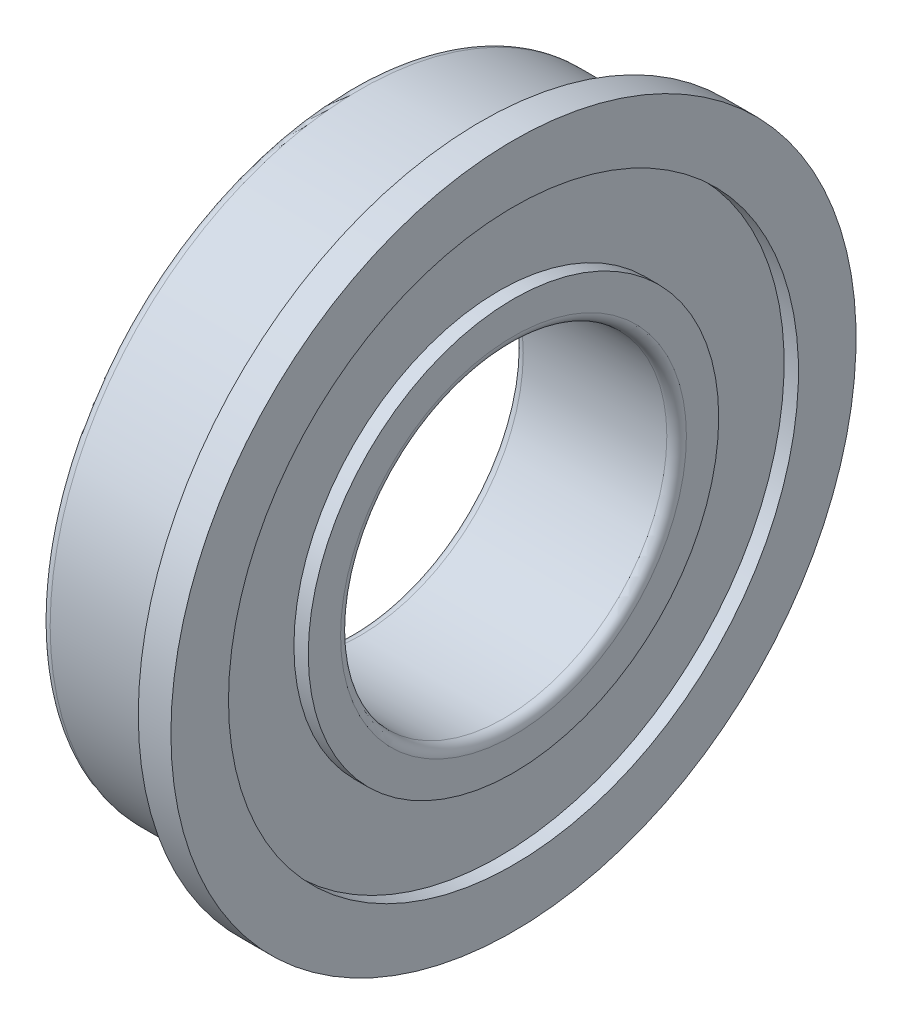
ISO-10303-21;
HEADER;
FILE_DESCRIPTION(('STEP AP214'),'2;1');
FILE_NAME('part.step','',(''),(''),'','','');
FILE_SCHEMA(('AUTOMOTIVE_DESIGN { 1 0 10303 214 1 1 1 1 }'));
ENDSEC;
DATA;
#1=APPLICATION_CONTEXT('core data for automotive mechanical design processes');
#2=APPLICATION_PROTOCOL_DEFINITION('international standard','automotive_design',2000,#1);
#3=PRODUCT_CONTEXT('',#1,'mechanical');
#4=PRODUCT('Part','Part','',(#3));
#5=PRODUCT_RELATED_PRODUCT_CATEGORY('part','',(#4));
#6=PRODUCT_DEFINITION_FORMATION('','',#4);
#7=PRODUCT_DEFINITION_CONTEXT('part definition',#1,'design');
#8=PRODUCT_DEFINITION('design','',#6,#7);
#9=PRODUCT_DEFINITION_SHAPE('','',#8);
#10=(LENGTH_UNIT() NAMED_UNIT(*) SI_UNIT(.MILLI.,.METRE.));
#11=(NAMED_UNIT(*) PLANE_ANGLE_UNIT() SI_UNIT($,.RADIAN.));
#12=(NAMED_UNIT(*) SI_UNIT($,.STERADIAN.) SOLID_ANGLE_UNIT());
#13=UNCERTAINTY_MEASURE_WITH_UNIT(LENGTH_MEASURE(1.E-05),#10,'distance_accuracy_value','');
#14=(GEOMETRIC_REPRESENTATION_CONTEXT(3) GLOBAL_UNCERTAINTY_ASSIGNED_CONTEXT((#13)) GLOBAL_UNIT_ASSIGNED_CONTEXT((#10,
#11,#12)) REPRESENTATION_CONTEXT('',''));
#15=CARTESIAN_POINT('',(0.,0.,0.));
#16=DIRECTION('',(0.,0.,1.));
#17=DIRECTION('',(1.,0.,0.));
#18=AXIS2_PLACEMENT_3D('',#15,#16,#17);
#19=CARTESIAN_POINT('',(-4.,0.,0.));
#20=DIRECTION('',(-1.,0.,0.));
#21=DIRECTION('',(0.,0.,1.));
#22=AXIS2_PLACEMENT_3D('',#19,#20,#21);
#23=CYLINDRICAL_SURFACE('',#22,10.5);
#24=CARTESIAN_POINT('',(0.,0.,0.));
#25=DIRECTION('',(-1.,0.,0.));
#26=DIRECTION('',(0.,0.,1.));
#27=AXIS2_PLACEMENT_3D('',#24,#25,#26);
#28=CIRCLE('',#27,10.5);
#29=CARTESIAN_POINT('',(0.,0.,10.5));
#30=VERTEX_POINT('',#29);
#31=EDGE_CURVE('E63',#30,#30,#28,.T.);
#32=ORIENTED_EDGE('',*,*,#31,.F.);
#33=EDGE_LOOP('',(#32));
#34=FACE_BOUND('',#33,.T.);
#35=CARTESIAN_POINT('',(0.999999999999999,0.,0.));
#36=DIRECTION('',(-1.,0.,0.));
#37=DIRECTION('',(0.,0.,1.));
#38=AXIS2_PLACEMENT_3D('',#35,#36,#37);
#39=CIRCLE('',#38,10.5);
#40=CARTESIAN_POINT('',(0.999999999999999,0.,10.5));
#41=VERTEX_POINT('',#40);
#42=EDGE_CURVE('E96',#41,#41,#39,.T.);
#43=ORIENTED_EDGE('',*,*,#42,.T.);
#44=EDGE_LOOP('',(#43));
#45=FACE_BOUND('',#44,.T.);
#46=ADVANCED_FACE('F37',(#34,#45),#23,.T.);
#47=CARTESIAN_POINT('',(0.,9.7,0.));
#48=DIRECTION('',(1.,0.,0.));
#49=DIRECTION('',(0.,0.,-1.));
#50=AXIS2_PLACEMENT_3D('',#47,#48,#49);
#51=PLANE('',#50);
#52=CARTESIAN_POINT('',(0.,0.,0.));
#53=DIRECTION('',(-1.,0.,0.));
#54=DIRECTION('',(0.,0.,1.));
#55=AXIS2_PLACEMENT_3D('',#52,#53,#54);
#56=CIRCLE('',#55,9.7);
#57=CARTESIAN_POINT('',(0.,0.,9.7));
#58=VERTEX_POINT('',#57);
#59=EDGE_CURVE('E66',#58,#58,#56,.T.);
#60=ORIENTED_EDGE('',*,*,#59,.F.);
#61=EDGE_LOOP('',(#60));
#62=FACE_BOUND('',#61,.T.);
#63=ORIENTED_EDGE('',*,*,#31,.T.);
#64=EDGE_LOOP('',(#63));
#65=FACE_BOUND('',#64,.T.);
#66=ADVANCED_FACE('F139',(#62,#65),#51,.F.);
#67=CARTESIAN_POINT('',(0.,0.,0.));
#68=DIRECTION('',(-1.,0.,0.));
#69=DIRECTION('',(0.,0.,1.));
#70=AXIS2_PLACEMENT_3D('',#67,#68,#69);
#71=TOROIDAL_SURFACE('',#70,9.5,0.2);
#72=CARTESIAN_POINT('',(-0.2,0.,0.));
#73=DIRECTION('',(-1.,0.,0.));
#74=DIRECTION('',(0.,0.,1.));
#75=AXIS2_PLACEMENT_3D('',#72,#73,#74);
#76=CIRCLE('',#75,9.5);
#77=CARTESIAN_POINT('',(-0.2,0.,9.5));
#78=VERTEX_POINT('',#77);
#79=EDGE_CURVE('E69',#78,#78,#76,.T.);
#80=ORIENTED_EDGE('',*,*,#79,.F.);
#81=EDGE_LOOP('',(#80));
#82=FACE_BOUND('',#81,.T.);
#83=ORIENTED_EDGE('',*,*,#59,.T.);
#84=EDGE_LOOP('',(#83));
#85=FACE_BOUND('',#84,.T.);
#86=ADVANCED_FACE('F145',(#82,#85),#71,.F.);
#87=CARTESIAN_POINT('',(-4.,0.,0.));
#88=DIRECTION('',(-1.,0.,0.));
#89=DIRECTION('',(0.,0.,1.));
#90=AXIS2_PLACEMENT_3D('',#87,#88,#89);
#91=CYLINDRICAL_SURFACE('',#90,9.5);
#92=CARTESIAN_POINT('',(-3.7,0.,0.));
#93=DIRECTION('',(1.,0.,0.));
#94=DIRECTION('',(0.,0.,-1.));
#95=AXIS2_PLACEMENT_3D('',#92,#93,#94);
#96=CIRCLE('',#95,9.5);
#97=CARTESIAN_POINT('',(-3.7,0.,-9.5));
#98=VERTEX_POINT('',#97);
#99=EDGE_CURVE('E10',#98,#98,#96,.T.);
#100=ORIENTED_EDGE('',*,*,#99,.T.);
#101=EDGE_LOOP('',(#100));
#102=FACE_BOUND('',#101,.T.);
#103=ORIENTED_EDGE('',*,*,#79,.T.);
#104=EDGE_LOOP('',(#103));
#105=FACE_BOUND('',#104,.T.);
#106=ADVANCED_FACE('F189',(#102,#105),#91,.T.);
#107=CARTESIAN_POINT('',(-4.,8.735,0.));
#108=DIRECTION('',(1.,0.,0.));
#109=DIRECTION('',(0.,0.,-1.));
#110=AXIS2_PLACEMENT_3D('',#107,#108,#109);
#111=PLANE('',#110);
#112=CARTESIAN_POINT('',(-4.,0.,0.));
#113=DIRECTION('',(1.,0.,0.));
#114=DIRECTION('',(0.,0.,-1.));
#115=AXIS2_PLACEMENT_3D('',#112,#113,#114);
#116=CIRCLE('',#115,9.2);
#117=CARTESIAN_POINT('',(-4.,0.,-9.2));
#118=VERTEX_POINT('',#117);
#119=EDGE_CURVE('E44',#118,#118,#116,.F.);
#120=ORIENTED_EDGE('',*,*,#119,.T.);
#121=EDGE_LOOP('',(#120));
#122=FACE_BOUND('',#121,.T.);
#123=CARTESIAN_POINT('',(-4.,0.,0.));
#124=DIRECTION('',(-1.,0.,0.));
#125=DIRECTION('',(0.,0.,1.));
#126=AXIS2_PLACEMENT_3D('',#123,#124,#125);
#127=CIRCLE('',#126,8.735);
#128=CARTESIAN_POINT('',(-4.,0.,8.735));
#129=VERTEX_POINT('',#128);
#130=EDGE_CURVE('E72',#129,#129,#127,.T.);
#131=ORIENTED_EDGE('',*,*,#130,.F.);
#132=EDGE_LOOP('',(#131));
#133=FACE_BOUND('',#132,.T.);
#134=ADVANCED_FACE('F184',(#122,#133),#111,.F.);
#135=CARTESIAN_POINT('',(-4.,0.,0.));
#136=DIRECTION('',(-1.,0.,0.));
#137=DIRECTION('',(0.,0.,1.));
#138=AXIS2_PLACEMENT_3D('',#135,#136,#137);
#139=CYLINDRICAL_SURFACE('',#138,8.735);
#140=CARTESIAN_POINT('',(-3.56,0.,0.));
#141=DIRECTION('',(-1.,0.,0.));
#142=DIRECTION('',(0.,0.,1.));
#143=AXIS2_PLACEMENT_3D('',#140,#141,#142);
#144=CIRCLE('',#143,8.735);
#145=CARTESIAN_POINT('',(-3.56,0.,8.735));
#146=VERTEX_POINT('',#145);
#147=EDGE_CURVE('E75',#146,#146,#144,.T.);
#148=ORIENTED_EDGE('',*,*,#147,.F.);
#149=EDGE_LOOP('',(#148));
#150=FACE_BOUND('',#149,.T.);
#151=ORIENTED_EDGE('',*,*,#130,.T.);
#152=EDGE_LOOP('',(#151));
#153=FACE_BOUND('',#152,.T.);
#154=ADVANCED_FACE('F178',(#150,#153),#139,.F.);
#155=CARTESIAN_POINT('',(-3.56,8.735,0.));
#156=DIRECTION('',(1.,0.,0.));
#157=DIRECTION('',(0.,0.,-1.));
#158=AXIS2_PLACEMENT_3D('',#155,#156,#157);
#159=PLANE('',#158);
#160=CARTESIAN_POINT('',(-3.56,0.,0.));
#161=DIRECTION('',(-1.,0.,0.));
#162=DIRECTION('',(0.,0.,1.));
#163=AXIS2_PLACEMENT_3D('',#160,#161,#162);
#164=CIRCLE('',#163,6.29);
#165=CARTESIAN_POINT('',(-3.56,0.,6.29));
#166=VERTEX_POINT('',#165);
#167=EDGE_CURVE('E78',#166,#166,#164,.T.);
#168=ORIENTED_EDGE('',*,*,#167,.F.);
#169=EDGE_LOOP('',(#168));
#170=FACE_BOUND('',#169,.T.);
#171=ORIENTED_EDGE('',*,*,#147,.T.);
#172=EDGE_LOOP('',(#171));
#173=FACE_BOUND('',#172,.T.);
#174=ADVANCED_FACE('F172',(#170,#173),#159,.F.);
#175=CARTESIAN_POINT('',(-4.,0.,0.));
#176=DIRECTION('',(-1.,0.,0.));
#177=DIRECTION('',(0.,0.,1.));
#178=AXIS2_PLACEMENT_3D('',#175,#176,#177);
#179=CYLINDRICAL_SURFACE('',#178,6.29);
#180=CARTESIAN_POINT('',(-4.,0.,0.));
#181=DIRECTION('',(-1.,0.,0.));
#182=DIRECTION('',(0.,0.,1.));
#183=AXIS2_PLACEMENT_3D('',#180,#181,#182);
#184=CIRCLE('',#183,6.29);
#185=CARTESIAN_POINT('',(-4.,0.,6.29));
#186=VERTEX_POINT('',#185);
#187=EDGE_CURVE('E81',#186,#186,#184,.T.);
#188=ORIENTED_EDGE('',*,*,#187,.F.);
#189=EDGE_LOOP('',(#188));
#190=FACE_BOUND('',#189,.T.);
#191=ORIENTED_EDGE('',*,*,#167,.T.);
#192=EDGE_LOOP('',(#191));
#193=FACE_BOUND('',#192,.T.);
#194=ADVANCED_FACE('F166',(#190,#193),#179,.T.);
#195=CARTESIAN_POINT('',(-4.,5.,0.));
#196=DIRECTION('',(1.,0.,0.));
#197=DIRECTION('',(0.,0.,-1.));
#198=AXIS2_PLACEMENT_3D('',#195,#196,#197);
#199=PLANE('',#198);
#200=CARTESIAN_POINT('',(-4.,0.,0.));
#201=DIRECTION('',(1.,0.,0.));
#202=DIRECTION('',(0.,0.,-1.));
#203=AXIS2_PLACEMENT_3D('',#200,#201,#202);
#204=CIRCLE('',#203,5.3);
#205=CARTESIAN_POINT('',(-4.,0.,-5.3));
#206=VERTEX_POINT('',#205);
#207=EDGE_CURVE('E48',#206,#206,#204,.T.);
#208=ORIENTED_EDGE('',*,*,#207,.T.);
#209=EDGE_LOOP('',(#208));
#210=FACE_BOUND('',#209,.T.);
#211=ORIENTED_EDGE('',*,*,#187,.T.);
#212=EDGE_LOOP('',(#211));
#213=FACE_BOUND('',#212,.T.);
#214=ADVANCED_FACE('F135',(#210,#213),#199,.F.);
#215=CARTESIAN_POINT('',(-4.,0.,0.));
#216=DIRECTION('',(-1.,0.,0.));
#217=DIRECTION('',(0.,0.,1.));
#218=AXIS2_PLACEMENT_3D('',#215,#216,#217);
#219=CYLINDRICAL_SURFACE('',#218,5.);
#220=CARTESIAN_POINT('',(0.699999999999999,0.,0.));
#221=DIRECTION('',(-1.,0.,0.));
#222=DIRECTION('',(0.,0.,1.));
#223=AXIS2_PLACEMENT_3D('',#220,#221,#222);
#224=CIRCLE('',#223,5.);
#225=CARTESIAN_POINT('',(0.699999999999999,0.,5.));
#226=VERTEX_POINT('',#225);
#227=EDGE_CURVE('E52',#226,#226,#224,.F.);
#228=ORIENTED_EDGE('',*,*,#227,.T.);
#229=EDGE_LOOP('',(#228));
#230=FACE_BOUND('',#229,.T.);
#231=CARTESIAN_POINT('',(-3.7,0.,0.));
#232=DIRECTION('',(1.,0.,0.));
#233=DIRECTION('',(0.,0.,-1.));
#234=AXIS2_PLACEMENT_3D('',#231,#232,#233);
#235=CIRCLE('',#234,5.);
#236=CARTESIAN_POINT('',(-3.7,0.,-5.));
#237=VERTEX_POINT('',#236);
#238=EDGE_CURVE('E57',#237,#237,#235,.F.);
#239=ORIENTED_EDGE('',*,*,#238,.T.);
#240=EDGE_LOOP('',(#239));
#241=FACE_BOUND('',#240,.T.);
#242=ADVANCED_FACE('F128',(#230,#241),#219,.F.);
#243=CARTESIAN_POINT('',(1.,6.29,0.));
#244=DIRECTION('',(-1.,0.,0.));
#245=DIRECTION('',(0.,0.,1.));
#246=AXIS2_PLACEMENT_3D('',#243,#244,#245);
#247=PLANE('',#246);
#248=CARTESIAN_POINT('',(1.,0.,0.));
#249=DIRECTION('',(-1.,0.,0.));
#250=DIRECTION('',(0.,0.,1.));
#251=AXIS2_PLACEMENT_3D('',#248,#249,#250);
#252=CIRCLE('',#251,5.3);
#253=CARTESIAN_POINT('',(1.,0.,5.3));
#254=VERTEX_POINT('',#253);
#255=EDGE_CURVE('E60',#254,#254,#252,.T.);
#256=ORIENTED_EDGE('',*,*,#255,.T.);
#257=EDGE_LOOP('',(#256));
#258=FACE_BOUND('',#257,.T.);
#259=CARTESIAN_POINT('',(0.999999999999999,0.,0.));
#260=DIRECTION('',(-1.,0.,0.));
#261=DIRECTION('',(0.,0.,1.));
#262=AXIS2_PLACEMENT_3D('',#259,#260,#261);
#263=CIRCLE('',#262,6.29);
#264=CARTESIAN_POINT('',(0.999999999999999,0.,6.29));
#265=VERTEX_POINT('',#264);
#266=EDGE_CURVE('E84',#265,#265,#263,.T.);
#267=ORIENTED_EDGE('',*,*,#266,.F.);
#268=EDGE_LOOP('',(#267));
#269=FACE_BOUND('',#268,.T.);
#270=ADVANCED_FACE('F123',(#258,#269),#247,.F.);
#271=CARTESIAN_POINT('',(-4.,0.,0.));
#272=DIRECTION('',(-1.,0.,0.));
#273=DIRECTION('',(0.,0.,1.));
#274=AXIS2_PLACEMENT_3D('',#271,#272,#273);
#275=CYLINDRICAL_SURFACE('',#274,6.29);
#276=CARTESIAN_POINT('',(0.559999999999999,0.,0.));
#277=DIRECTION('',(-1.,0.,0.));
#278=DIRECTION('',(0.,0.,1.));
#279=AXIS2_PLACEMENT_3D('',#276,#277,#278);
#280=CIRCLE('',#279,6.29);
#281=CARTESIAN_POINT('',(0.559999999999999,0.,6.29));
#282=VERTEX_POINT('',#281);
#283=EDGE_CURVE('E87',#282,#282,#280,.T.);
#284=ORIENTED_EDGE('',*,*,#283,.F.);
#285=EDGE_LOOP('',(#284));
#286=FACE_BOUND('',#285,.T.);
#287=ORIENTED_EDGE('',*,*,#266,.T.);
#288=EDGE_LOOP('',(#287));
#289=FACE_BOUND('',#288,.T.);
#290=ADVANCED_FACE('F117',(#286,#289),#275,.T.);
#291=CARTESIAN_POINT('',(0.559999999999999,8.735,0.));
#292=DIRECTION('',(-1.,0.,0.));
#293=DIRECTION('',(0.,0.,1.));
#294=AXIS2_PLACEMENT_3D('',#291,#292,#293);
#295=PLANE('',#294);
#296=CARTESIAN_POINT('',(0.559999999999999,0.,0.));
#297=DIRECTION('',(-1.,0.,0.));
#298=DIRECTION('',(0.,0.,1.));
#299=AXIS2_PLACEMENT_3D('',#296,#297,#298);
#300=CIRCLE('',#299,8.735);
#301=CARTESIAN_POINT('',(0.559999999999999,0.,8.735));
#302=VERTEX_POINT('',#301);
#303=EDGE_CURVE('E90',#302,#302,#300,.T.);
#304=ORIENTED_EDGE('',*,*,#303,.F.);
#305=EDGE_LOOP('',(#304));
#306=FACE_BOUND('',#305,.T.);
#307=ORIENTED_EDGE('',*,*,#283,.T.);
#308=EDGE_LOOP('',(#307));
#309=FACE_BOUND('',#308,.T.);
#310=ADVANCED_FACE('F111',(#306,#309),#295,.F.);
#311=CARTESIAN_POINT('',(-4.,0.,0.));
#312=DIRECTION('',(-1.,0.,0.));
#313=DIRECTION('',(0.,0.,1.));
#314=AXIS2_PLACEMENT_3D('',#311,#312,#313);
#315=CYLINDRICAL_SURFACE('',#314,8.735);
#316=CARTESIAN_POINT('',(0.999999999999999,0.,0.));
#317=DIRECTION('',(-1.,0.,0.));
#318=DIRECTION('',(0.,0.,1.));
#319=AXIS2_PLACEMENT_3D('',#316,#317,#318);
#320=CIRCLE('',#319,8.735);
#321=CARTESIAN_POINT('',(0.999999999999999,0.,8.735));
#322=VERTEX_POINT('',#321);
#323=EDGE_CURVE('E93',#322,#322,#320,.T.);
#324=ORIENTED_EDGE('',*,*,#323,.F.);
#325=EDGE_LOOP('',(#324));
#326=FACE_BOUND('',#325,.T.);
#327=ORIENTED_EDGE('',*,*,#303,.T.);
#328=EDGE_LOOP('',(#327));
#329=FACE_BOUND('',#328,.T.);
#330=ADVANCED_FACE('F105',(#326,#329),#315,.F.);
#331=CARTESIAN_POINT('',(0.999999999999999,10.5,0.));
#332=DIRECTION('',(-1.,0.,0.));
#333=DIRECTION('',(0.,0.,1.));
#334=AXIS2_PLACEMENT_3D('',#331,#332,#333);
#335=PLANE('',#334);
#336=ORIENTED_EDGE('',*,*,#42,.F.);
#337=EDGE_LOOP('',(#336));
#338=FACE_BOUND('',#337,.T.);
#339=ORIENTED_EDGE('',*,*,#323,.T.);
#340=EDGE_LOOP('',(#339));
#341=FACE_BOUND('',#340,.T.);
#342=ADVANCED_FACE('F101',(#338,#341),#335,.F.);
#343=CARTESIAN_POINT('',(0.699999999999999,0.,0.));
#344=DIRECTION('',(-1.,0.,0.));
#345=DIRECTION('',(0.,0.,1.));
#346=AXIS2_PLACEMENT_3D('',#343,#344,#345);
#347=TOROIDAL_SURFACE('',#346,5.3,0.3);
#348=ORIENTED_EDGE('',*,*,#227,.F.);
#349=EDGE_LOOP('',(#348));
#350=FACE_BOUND('',#349,.T.);
#351=ORIENTED_EDGE('',*,*,#255,.F.);
#352=EDGE_LOOP('',(#351));
#353=FACE_BOUND('',#352,.T.);
#354=ADVANCED_FACE('F104',(#350,#353),#347,.T.);
#355=CARTESIAN_POINT('',(-3.7,0.,0.));
#356=DIRECTION('',(1.,0.,0.));
#357=DIRECTION('',(0.,0.,-1.));
#358=AXIS2_PLACEMENT_3D('',#355,#356,#357);
#359=TOROIDAL_SURFACE('',#358,5.3,0.3);
#360=ORIENTED_EDGE('',*,*,#207,.F.);
#361=EDGE_LOOP('',(#360));
#362=FACE_BOUND('',#361,.T.);
#363=ORIENTED_EDGE('',*,*,#238,.F.);
#364=EDGE_LOOP('',(#363));
#365=FACE_BOUND('',#364,.T.);
#366=ADVANCED_FACE('F151',(#362,#365),#359,.T.);
#367=CARTESIAN_POINT('',(-3.7,0.,0.));
#368=DIRECTION('',(1.,0.,0.));
#369=DIRECTION('',(0.,0.,-1.));
#370=AXIS2_PLACEMENT_3D('',#367,#368,#369);
#371=TOROIDAL_SURFACE('',#370,9.2,0.3);
#372=ORIENTED_EDGE('',*,*,#99,.F.);
#373=EDGE_LOOP('',(#372));
#374=FACE_BOUND('',#373,.T.);
#375=ORIENTED_EDGE('',*,*,#119,.F.);
#376=EDGE_LOOP('',(#375));
#377=FACE_BOUND('',#376,.T.);
#378=ADVANCED_FACE('F39',(#374,#377),#371,.T.);
#379=CLOSED_SHELL('',(#46,#66,#86,#106,#134,#154,#174,#194,#214,#242,#270,#290,#310,#330,#342,
#354,#366,#378));
#380=MANIFOLD_SOLID_BREP('B2',#379);
#381=ADVANCED_BREP_SHAPE_REPRESENTATION('',(#18,#380),#14);
#382=SHAPE_DEFINITION_REPRESENTATION(#9,#381);
ENDSEC;
END-ISO-10303-21;
